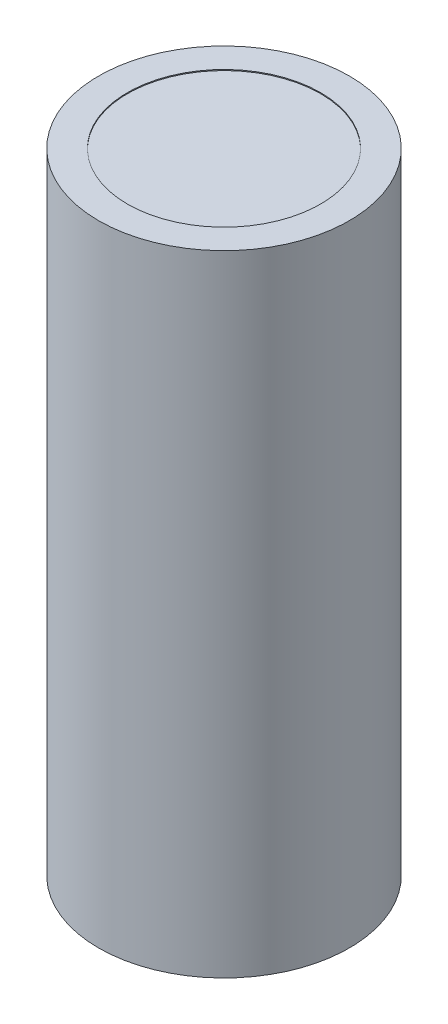
ISO-10303-21;
HEADER;
FILE_DESCRIPTION(('STEP AP214'),'2;1');
FILE_NAME('part.step','',(''),(''),'','','');
FILE_SCHEMA(('AUTOMOTIVE_DESIGN { 1 0 10303 214 1 1 1 1 }'));
ENDSEC;
DATA;
#1=APPLICATION_CONTEXT('core data for automotive mechanical design processes');
#2=APPLICATION_PROTOCOL_DEFINITION('international standard','automotive_design',2000,#1);
#3=PRODUCT_CONTEXT('',#1,'mechanical');
#4=PRODUCT('Part','Part','',(#3));
#5=PRODUCT_RELATED_PRODUCT_CATEGORY('part','',(#4));
#6=PRODUCT_DEFINITION_FORMATION('','',#4);
#7=PRODUCT_DEFINITION_CONTEXT('part definition',#1,'design');
#8=PRODUCT_DEFINITION('design','',#6,#7);
#9=PRODUCT_DEFINITION_SHAPE('','',#8);
#10=(LENGTH_UNIT() NAMED_UNIT(*) SI_UNIT(.MILLI.,.METRE.));
#11=(NAMED_UNIT(*) PLANE_ANGLE_UNIT() SI_UNIT($,.RADIAN.));
#12=(NAMED_UNIT(*) SI_UNIT($,.STERADIAN.) SOLID_ANGLE_UNIT());
#13=UNCERTAINTY_MEASURE_WITH_UNIT(LENGTH_MEASURE(1.E-05),#10,'distance_accuracy_value','');
#14=(GEOMETRIC_REPRESENTATION_CONTEXT(3) GLOBAL_UNCERTAINTY_ASSIGNED_CONTEXT((#13)) GLOBAL_UNIT_ASSIGNED_CONTEXT((#10,
#11,#12)) REPRESENTATION_CONTEXT('',''));
#15=CARTESIAN_POINT('',(0.,0.,0.));
#16=DIRECTION('',(0.,0.,1.));
#17=DIRECTION('',(1.,0.,0.));
#18=AXIS2_PLACEMENT_3D('',#15,#16,#17);
#19=CARTESIAN_POINT('',(0.,65.7,0.));
#20=DIRECTION('',(0.,-1.,0.));
#21=DIRECTION('',(0.,0.,-1.));
#22=AXIS2_PLACEMENT_3D('',#19,#20,#21);
#23=CYLINDRICAL_SURFACE('',#22,13.075);
#24=CARTESIAN_POINT('',(0.,65.7,0.));
#25=DIRECTION('',(0.,1.,0.));
#26=DIRECTION('',(0.,0.,1.));
#27=AXIS2_PLACEMENT_3D('',#24,#25,#26);
#28=CIRCLE('',#27,13.075);
#29=CARTESIAN_POINT('',(0.,65.7,13.075));
#30=VERTEX_POINT('',#29);
#31=EDGE_CURVE('E10',#30,#30,#28,.T.);
#32=ORIENTED_EDGE('',*,*,#31,.F.);
#33=EDGE_LOOP('',(#32));
#34=FACE_BOUND('',#33,.T.);
#35=CARTESIAN_POINT('',(0.,0.,0.));
#36=DIRECTION('',(0.,1.,0.));
#37=DIRECTION('',(0.,0.,1.));
#38=AXIS2_PLACEMENT_3D('',#35,#36,#37);
#39=CIRCLE('',#38,13.075);
#40=CARTESIAN_POINT('',(0.,0.,13.075));
#41=VERTEX_POINT('',#40);
#42=EDGE_CURVE('E45',#41,#41,#39,.T.);
#43=ORIENTED_EDGE('',*,*,#42,.T.);
#44=EDGE_LOOP('',(#43));
#45=FACE_BOUND('',#44,.T.);
#46=ADVANCED_FACE('F42',(#34,#45),#23,.T.);
#47=CARTESIAN_POINT('',(0.,65.7,0.));
#48=DIRECTION('',(0.,1.,0.));
#49=DIRECTION('',(0.,0.,1.));
#50=AXIS2_PLACEMENT_3D('',#47,#48,#49);
#51=PLANE('',#50);
#52=CARTESIAN_POINT('',(0.,65.7,0.));
#53=DIRECTION('',(0.,1.,0.));
#54=DIRECTION('',(0.,0.,1.));
#55=AXIS2_PLACEMENT_3D('',#52,#53,#54);
#56=CIRCLE('',#55,10.075);
#57=CARTESIAN_POINT('',(0.,65.7,10.075));
#58=VERTEX_POINT('',#57);
#59=EDGE_CURVE('E56',#58,#58,#56,.T.);
#60=ORIENTED_EDGE('',*,*,#59,.F.);
#61=EDGE_LOOP('',(#60));
#62=FACE_BOUND('',#61,.T.);
#63=ORIENTED_EDGE('',*,*,#31,.T.);
#64=EDGE_LOOP('',(#63));
#65=FACE_BOUND('',#64,.T.);
#66=ADVANCED_FACE('F100',(#62,#65),#51,.T.);
#67=CARTESIAN_POINT('',(0.,0.,0.));
#68=DIRECTION('',(0.,1.,0.));
#69=DIRECTION('',(0.,0.,1.));
#70=AXIS2_PLACEMENT_3D('',#67,#68,#69);
#71=PLANE('',#70);
#72=CARTESIAN_POINT('',(0.,0.,0.));
#73=DIRECTION('',(0.,-1.,0.));
#74=DIRECTION('',(0.,0.,-1.));
#75=AXIS2_PLACEMENT_3D('',#72,#73,#74);
#76=CIRCLE('',#75,8.575);
#77=CARTESIAN_POINT('',(0.,0.,-8.575));
#78=VERTEX_POINT('',#77);
#79=EDGE_CURVE('E64',#78,#78,#76,.T.);
#80=ORIENTED_EDGE('',*,*,#79,.F.);
#81=EDGE_LOOP('',(#80));
#82=FACE_BOUND('',#81,.T.);
#83=ORIENTED_EDGE('',*,*,#42,.F.);
#84=EDGE_LOOP('',(#83));
#85=FACE_BOUND('',#84,.T.);
#86=ADVANCED_FACE('F96',(#82,#85),#71,.F.);
#87=CARTESIAN_POINT('',(0.,65.6,0.));
#88=DIRECTION('',(0.,1.,0.));
#89=DIRECTION('',(0.,0.,1.));
#90=AXIS2_PLACEMENT_3D('',#87,#88,#89);
#91=CYLINDRICAL_SURFACE('',#90,10.075);
#92=CARTESIAN_POINT('',(0.,65.6,0.));
#93=DIRECTION('',(0.,1.,0.));
#94=DIRECTION('',(0.,0.,1.));
#95=AXIS2_PLACEMENT_3D('',#92,#93,#94);
#96=CIRCLE('',#95,10.075);
#97=CARTESIAN_POINT('',(0.,65.6,10.075));
#98=VERTEX_POINT('',#97);
#99=EDGE_CURVE('E54',#98,#98,#96,.T.);
#100=ORIENTED_EDGE('',*,*,#99,.F.);
#101=EDGE_LOOP('',(#100));
#102=FACE_BOUND('',#101,.T.);
#103=ORIENTED_EDGE('',*,*,#59,.T.);
#104=EDGE_LOOP('',(#103));
#105=FACE_BOUND('',#104,.T.);
#106=ADVANCED_FACE('F99',(#102,#105),#91,.F.);
#107=CARTESIAN_POINT('',(0.,65.6,0.));
#108=DIRECTION('',(0.,1.,0.));
#109=DIRECTION('',(0.,0.,1.));
#110=AXIS2_PLACEMENT_3D('',#107,#108,#109);
#111=PLANE('',#110);
#112=ORIENTED_EDGE('',*,*,#99,.T.);
#113=EDGE_LOOP('',(#112));
#114=FACE_BOUND('',#113,.T.);
#115=ADVANCED_FACE('F92',(#114),#111,.T.);
#116=CARTESIAN_POINT('',(0.,2.,0.));
#117=DIRECTION('',(0.,-1.,0.));
#118=DIRECTION('',(0.,0.,-1.));
#119=AXIS2_PLACEMENT_3D('',#116,#117,#118);
#120=CYLINDRICAL_SURFACE('',#119,8.575);
#121=CARTESIAN_POINT('',(0.,2.,0.));
#122=DIRECTION('',(0.,-1.,0.));
#123=DIRECTION('',(0.,0.,-1.));
#124=AXIS2_PLACEMENT_3D('',#121,#122,#123);
#125=CIRCLE('',#124,8.575);
#126=CARTESIAN_POINT('',(0.,2.,-8.575));
#127=VERTEX_POINT('',#126);
#128=EDGE_CURVE('E60',#127,#127,#125,.T.);
#129=ORIENTED_EDGE('',*,*,#128,.F.);
#130=EDGE_LOOP('',(#129));
#131=FACE_BOUND('',#130,.T.);
#132=ORIENTED_EDGE('',*,*,#79,.T.);
#133=EDGE_LOOP('',(#132));
#134=FACE_BOUND('',#133,.T.);
#135=ADVANCED_FACE('F86',(#131,#134),#120,.F.);
#136=CARTESIAN_POINT('',(0.,2.,0.));
#137=DIRECTION('',(0.,-1.,0.));
#138=DIRECTION('',(0.,0.,-1.));
#139=AXIS2_PLACEMENT_3D('',#136,#137,#138);
#140=PLANE('',#139);
#141=CARTESIAN_POINT('',(0.,2.,0.));
#142=DIRECTION('',(0.,-1.,0.));
#143=DIRECTION('',(0.,0.,-1.));
#144=AXIS2_PLACEMENT_3D('',#141,#142,#143);
#145=CIRCLE('',#144,7.075);
#146=CARTESIAN_POINT('',(0.,2.,-7.075));
#147=VERTEX_POINT('',#146);
#148=EDGE_CURVE('E68',#147,#147,#145,.T.);
#149=ORIENTED_EDGE('',*,*,#148,.F.);
#150=EDGE_LOOP('',(#149));
#151=FACE_BOUND('',#150,.T.);
#152=ORIENTED_EDGE('',*,*,#128,.T.);
#153=EDGE_LOOP('',(#152));
#154=FACE_BOUND('',#153,.T.);
#155=ADVANCED_FACE('F83',(#151,#154),#140,.T.);
#156=CARTESIAN_POINT('',(0.,2.,0.));
#157=DIRECTION('',(0.,-1.,0.));
#158=DIRECTION('',(0.,0.,-1.));
#159=AXIS2_PLACEMENT_3D('',#156,#157,#158);
#160=CYLINDRICAL_SURFACE('',#159,7.075);
#161=ORIENTED_EDGE('',*,*,#148,.T.);
#162=EDGE_LOOP('',(#161));
#163=FACE_BOUND('',#162,.T.);
#164=CARTESIAN_POINT('',(0.,0.,0.));
#165=DIRECTION('',(0.,-1.,0.));
#166=DIRECTION('',(0.,0.,-1.));
#167=AXIS2_PLACEMENT_3D('',#164,#165,#166);
#168=CIRCLE('',#167,7.075);
#169=CARTESIAN_POINT('',(0.,0.,-7.075));
#170=VERTEX_POINT('',#169);
#171=EDGE_CURVE('E72',#170,#170,#168,.T.);
#172=ORIENTED_EDGE('',*,*,#171,.F.);
#173=EDGE_LOOP('',(#172));
#174=FACE_BOUND('',#173,.T.);
#175=ADVANCED_FACE('F80',(#163,#174),#160,.T.);
#176=ORIENTED_EDGE('',*,*,#171,.T.);
#177=EDGE_LOOP('',(#176));
#178=FACE_BOUND('',#177,.T.);
#179=ADVANCED_FACE('F101',(#178),#71,.F.);
#180=CLOSED_SHELL('',(#46,#66,#86,#106,#115,#135,#155,#175,#179));
#181=MANIFOLD_SOLID_BREP('B2',#180);
#182=ADVANCED_BREP_SHAPE_REPRESENTATION('',(#18,#181),#14);
#183=SHAPE_DEFINITION_REPRESENTATION(#9,#182);
ENDSEC;
END-ISO-10303-21;
